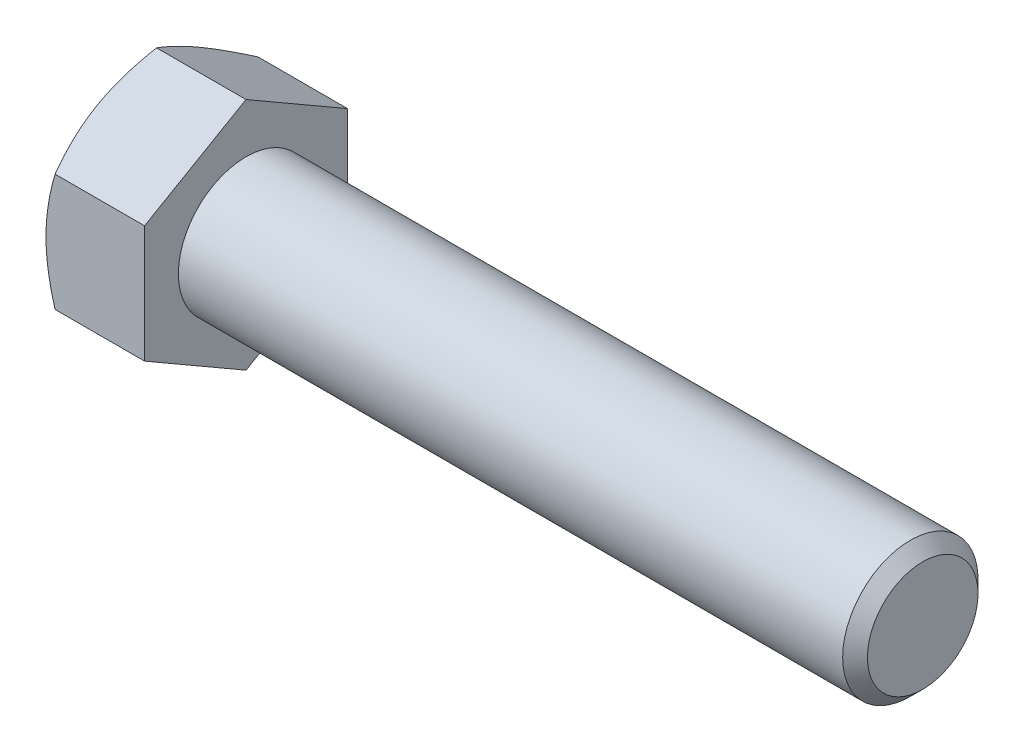
ISO-10303-21;
HEADER;
FILE_DESCRIPTION(('STEP AP214'),'2;1');
FILE_NAME('part.step','',(''),(''),'','','');
FILE_SCHEMA(('AUTOMOTIVE_DESIGN { 1 0 10303 214 1 1 1 1 }'));
ENDSEC;
DATA;
#1=APPLICATION_CONTEXT('core data for automotive mechanical design processes');
#2=APPLICATION_PROTOCOL_DEFINITION('international standard','automotive_design',2000,#1);
#3=PRODUCT_CONTEXT('',#1,'mechanical');
#4=PRODUCT('Part','Part','',(#3));
#5=PRODUCT_RELATED_PRODUCT_CATEGORY('part','',(#4));
#6=PRODUCT_DEFINITION_FORMATION('','',#4);
#7=PRODUCT_DEFINITION_CONTEXT('part definition',#1,'design');
#8=PRODUCT_DEFINITION('design','',#6,#7);
#9=PRODUCT_DEFINITION_SHAPE('','',#8);
#10=(LENGTH_UNIT() NAMED_UNIT(*) SI_UNIT(.MILLI.,.METRE.));
#11=(NAMED_UNIT(*) PLANE_ANGLE_UNIT() SI_UNIT($,.RADIAN.));
#12=(NAMED_UNIT(*) SI_UNIT($,.STERADIAN.) SOLID_ANGLE_UNIT());
#13=UNCERTAINTY_MEASURE_WITH_UNIT(LENGTH_MEASURE(1.E-05),#10,'distance_accuracy_value','');
#14=(GEOMETRIC_REPRESENTATION_CONTEXT(3) GLOBAL_UNCERTAINTY_ASSIGNED_CONTEXT((#13)) GLOBAL_UNIT_ASSIGNED_CONTEXT((#10,
#11,#12)) REPRESENTATION_CONTEXT('',''));
#15=CARTESIAN_POINT('',(0.,0.,0.));
#16=DIRECTION('',(0.,0.,1.));
#17=DIRECTION('',(1.,0.,0.));
#18=AXIS2_PLACEMENT_3D('',#15,#16,#17);
#19=CARTESIAN_POINT('',(9.2456,5.49926131403118,-9.525));
#20=DIRECTION('',(0.,-0.866025403784438,0.500000000000001));
#21=DIRECTION('',(0.,-0.500000000000001,-0.866025403784438));
#22=AXIS2_PLACEMENT_3D('',#19,#20,#21);
#23=PLANE('',#22);
#24=CARTESIAN_POINT('',(0.850805353685338,10.9986380981162,0.000199999999999582));
#25=CARTESIAN_POINT('',(0.781023201247652,10.8777523132173,-0.209180321357815));
#26=CARTESIAN_POINT('',(0.714408233957874,10.7564158029679,-0.419341321922845));
#27=CARTESIAN_POINT('',(0.588391469790024,10.5127697532954,-0.841348659019077));
#28=CARTESIAN_POINT('',(0.528992045309775,10.3904599078574,-1.05319552558363));
#29=CARTESIAN_POINT('',(0.362766604707595,10.0215595864394,-1.69214962520808));
#30=CARTESIAN_POINT('',(0.268218329918824,9.77351282584137,-2.12177921721668));
#31=CARTESIAN_POINT('',(0.157351628845432,9.40232220358294,-2.76470023426138));
#32=CARTESIAN_POINT('',(0.125769866148955,9.28028730086356,-2.97607088606807));
#33=CARTESIAN_POINT('',(0.0728092531292055,9.03565248016184,-3.39979082482397));
#34=CARTESIAN_POINT('',(0.051430599181033,8.91305255135051,-3.61214013052952));
#35=CARTESIAN_POINT('',(0.0194239766724823,8.66764818787802,-4.03719295646297));
#36=CARTESIAN_POINT('',(0.00878323258550216,8.54484417077186,-4.24989575346439));
#37=CARTESIAN_POINT('',(-0.00152146504907495,8.29912270270345,-4.67549782066929));
#38=CARTESIAN_POINT('',(-0.00118575773535193,8.17620525536319,-4.8883970845993));
#39=CARTESIAN_POINT('',(0.00969884023177768,7.94640807689151,-5.28641747314822));
#40=CARTESIAN_POINT('',(0.0189199445075662,7.83951212670956,-5.4715666899867));
#41=CARTESIAN_POINT('',(0.0454848010115649,7.62597023317658,-5.84143209913029));
#42=CARTESIAN_POINT('',(0.0628291278252538,7.5193243080471,-6.02614825987472));
#43=CARTESIAN_POINT('',(0.126636878025748,7.19979976097279,-6.57958100967286));
#44=CARTESIAN_POINT('',(0.184867121471558,6.98748672019119,-6.94731798341605));
#45=CARTESIAN_POINT('',(0.330443291970775,6.56060850831896,-7.68669273502289));
#46=CARTESIAN_POINT('',(0.41840629634645,6.3460978161353,-8.05823615265175));
#47=CARTESIAN_POINT('',(0.618045797355986,5.92027529884848,-8.79578238759941));
#48=CARTESIAN_POINT('',(0.729675405460146,5.70895802095901,-9.16179464942111));
#49=CARTESIAN_POINT('',(0.850805353685331,5.49914584397734,-9.5252));
#50=B_SPLINE_CURVE_WITH_KNOTS('',3,(#24,#25,#26,#27,#28,#29,#30,#31,#32,#33,#34,#35,#36,#37,#38,
#39,#40,#41,#42,#43,#44,#45,#46,#47,#48,#49),.UNSPECIFIED.,.F.,.F.,(4,2,2,2,2,2,2,2,2,2,2,2,4),
(0.,0.754861746958002,1.50997101692212,3.02340406075151,3.76154608748043,4.49970232035707,
5.23697928598072,5.97423347202913,6.61604550518408,7.25790294292824,8.54252993638602,
9.85564695316764,11.1661863217647),.UNSPECIFIED.);
#51=CARTESIAN_POINT('',(0.850738685968814,10.9985226280624,0.));
#52=VERTEX_POINT('',#51);
#53=CARTESIAN_POINT('',(0.,8.24889197104677,-4.76250000000001));
#54=VERTEX_POINT('',#53);
#55=EDGE_CURVE('E49',#52,#54,#50,.T.);
#56=ORIENTED_EDGE('',*,*,#55,.F.);
#57=DIRECTION('',(-1.,0.,0.));
#58=VECTOR('',#57,1.);
#59=CARTESIAN_POINT('',(9.2456,10.9985226280624,0.));
#60=LINE('',#59,#58);
#61=CARTESIAN_POINT('',(9.2456,10.9985226280624,0.));
#62=VERTEX_POINT('',#61);
#63=EDGE_CURVE('E145',#62,#52,#60,.T.);
#64=ORIENTED_EDGE('',*,*,#63,.F.);
#65=DIRECTION('',(0.,0.500000000000001,0.866025403784438));
#66=VECTOR('',#65,1.);
#67=CARTESIAN_POINT('',(9.2456,5.49926131403118,-9.525));
#68=LINE('',#67,#66);
#69=CARTESIAN_POINT('',(9.2456,5.49926131403118,-9.525));
#70=VERTEX_POINT('',#69);
#71=EDGE_CURVE('E236',#70,#62,#68,.T.);
#72=ORIENTED_EDGE('',*,*,#71,.F.);
#73=DIRECTION('',(-1.,0.,0.));
#74=VECTOR('',#73,1.);
#75=CARTESIAN_POINT('',(9.2456,5.49926131403118,-9.525));
#76=LINE('',#75,#74);
#77=CARTESIAN_POINT('',(0.850738685968808,5.49926131403118,-9.525));
#78=VERTEX_POINT('',#77);
#79=EDGE_CURVE('E133',#70,#78,#76,.T.);
#80=ORIENTED_EDGE('',*,*,#79,.T.);
#81=EDGE_CURVE('E127',#54,#78,#50,.T.);
#82=ORIENTED_EDGE('',*,*,#81,.F.);
#83=EDGE_LOOP('',(#56,#64,#72,#80,#82));
#84=FACE_BOUND('',#83,.T.);
#85=ADVANCED_FACE('F33',(#84),#23,.F.);
#86=CARTESIAN_POINT('',(9.2456,10.9985226280624,0.));
#87=DIRECTION('',(0.,-0.866025403784438,-0.500000000000001));
#88=DIRECTION('',(0.,0.500000000000001,-0.866025403784438));
#89=AXIS2_PLACEMENT_3D('',#86,#87,#88);
#90=PLANE('',#89);
#91=CARTESIAN_POINT('',(0.850805353685332,5.49914584397734,9.5252));
#92=CARTESIAN_POINT('',(0.781023201247648,5.62003162887628,9.31581967864219));
#93=CARTESIAN_POINT('',(0.71440823395787,5.74136813912567,9.10565867807715));
#94=CARTESIAN_POINT('',(0.58839146979002,5.98501418879817,8.68365134098092));
#95=CARTESIAN_POINT('',(0.52899204530977,6.1073240342362,8.47180447441637));
#96=CARTESIAN_POINT('',(0.36276660470759,6.47622435565419,7.83285037479193));
#97=CARTESIAN_POINT('',(0.268218329918821,6.72427111625218,7.40322078278332));
#98=CARTESIAN_POINT('',(0.157351628845429,7.09546173851061,6.76029976573862));
#99=CARTESIAN_POINT('',(0.125769866148953,7.21749664122999,6.54892911393193));
#100=CARTESIAN_POINT('',(0.0728092531292032,7.46213146193172,6.12520917517604));
#101=CARTESIAN_POINT('',(0.0514305991810314,7.58473139074305,5.91285986947049));
#102=CARTESIAN_POINT('',(0.0194239766724808,7.83013575421554,5.48780704353704));
#103=CARTESIAN_POINT('',(0.00878323258550018,7.95293977132169,5.27510424653562));
#104=CARTESIAN_POINT('',(-0.00152146504907647,8.1986612393901,4.84950217933072));
#105=CARTESIAN_POINT('',(-0.00118575773535245,8.32157868673037,4.63660291540071));
#106=CARTESIAN_POINT('',(0.00969884023177815,8.55137586520205,4.23858252685179));
#107=CARTESIAN_POINT('',(0.0189199445075668,8.658271815384,4.05343331001331));
#108=CARTESIAN_POINT('',(0.0454848010115661,8.87181370891698,3.68356790086971));
#109=CARTESIAN_POINT('',(0.0628291278252554,8.97845963404645,3.49885174012528));
#110=CARTESIAN_POINT('',(0.12663687802575,9.29798418112076,2.94541899032714));
#111=CARTESIAN_POINT('',(0.18486712147156,9.51029722190237,2.57768201658395));
#112=CARTESIAN_POINT('',(0.330443291970779,9.93717543377459,1.83830726497711));
#113=CARTESIAN_POINT('',(0.418406296346454,10.1516861259583,1.46676384734825));
#114=CARTESIAN_POINT('',(0.618045797355993,10.5775086432451,0.729217612400586));
#115=CARTESIAN_POINT('',(0.729675405460153,10.7888259211345,0.363205350578885));
#116=CARTESIAN_POINT('',(0.850805353685338,10.9986380981162,-0.000199999999999493));
#117=B_SPLINE_CURVE_WITH_KNOTS('',3,(#91,#92,#93,#94,#95,#96,#97,#98,#99,#100,#101,#102,#103,
#104,#105,#106,#107,#108,#109,#110,#111,#112,#113,#114,#115,#116),.UNSPECIFIED.,.F.,.F.,(4,2,2,
2,2,2,2,2,2,2,2,2,4),(0.,0.754861746958003,1.50997101692211,3.02340406075151,3.76154608748042,
4.49970232035707,5.23697928598072,5.97423347202913,6.61604550518408,7.25790294292823,
8.54252993638602,9.85564695316764,11.1661863217647),.UNSPECIFIED.);
#118=CARTESIAN_POINT('',(0.850738685968808,5.49926131403118,9.525));
#119=VERTEX_POINT('',#118);
#120=CARTESIAN_POINT('',(0.,8.24889197104677,4.76250000000001));
#121=VERTEX_POINT('',#120);
#122=EDGE_CURVE('E56',#119,#121,#117,.T.);
#123=ORIENTED_EDGE('',*,*,#122,.F.);
#124=DIRECTION('',(-1.,0.,0.));
#125=VECTOR('',#124,1.);
#126=CARTESIAN_POINT('',(9.2456,5.49926131403118,9.525));
#127=LINE('',#126,#125);
#128=CARTESIAN_POINT('',(9.2456,5.49926131403118,9.525));
#129=VERTEX_POINT('',#128);
#130=EDGE_CURVE('E143',#129,#119,#127,.T.);
#131=ORIENTED_EDGE('',*,*,#130,.F.);
#132=DIRECTION('',(0.,-0.500000000000001,0.866025403784438));
#133=VECTOR('',#132,1.);
#134=CARTESIAN_POINT('',(9.2456,10.9985226280624,0.));
#135=LINE('',#134,#133);
#136=EDGE_CURVE('E234',#62,#129,#135,.T.);
#137=ORIENTED_EDGE('',*,*,#136,.F.);
#138=ORIENTED_EDGE('',*,*,#63,.T.);
#139=EDGE_CURVE('E160',#121,#52,#117,.T.);
#140=ORIENTED_EDGE('',*,*,#139,.F.);
#141=EDGE_LOOP('',(#123,#131,#137,#138,#140));
#142=FACE_BOUND('',#141,.T.);
#143=ADVANCED_FACE('F166',(#142),#90,.F.);
#144=CARTESIAN_POINT('',(9.2456,5.49926131403118,9.525));
#145=DIRECTION('',(0.,0.,-1.));
#146=DIRECTION('',(0.,1.,0.));
#147=AXIS2_PLACEMENT_3D('',#144,#145,#146);
#148=PLANE('',#147);
#149=CARTESIAN_POINT('',(4.65297862037688,-14.781011537015,9.525));
#150=CARTESIAN_POINT('',(4.55200114715193,-14.5729402852111,9.525));
#151=CARTESIAN_POINT('',(4.4515265786935,-14.3646250848645,9.525));
#152=CARTESIAN_POINT('',(4.25169715286499,-13.9474558852266,9.525));
#153=CARTESIAN_POINT('',(4.15234230671206,-13.7386018805634,9.525));
#154=CARTESIAN_POINT('',(3.85610205099883,-13.1110997607544,9.525));
#155=CARTESIAN_POINT('',(3.66107082960236,-12.6915729931106,9.525));
#156=CARTESIAN_POINT('',(3.27608312858325,-11.8474364822057,9.525));
#157=CARTESIAN_POINT('',(3.08615996532047,-11.4228115073574,9.525));
#158=CARTESIAN_POINT('',(2.71407238177896,-10.5701875185262,9.525));
#159=CARTESIAN_POINT('',(2.5319075952033,-10.1421886649677,9.525));
#160=CARTESIAN_POINT('',(2.17173180429313,-9.26840827813856,9.525));
#161=CARTESIAN_POINT('',(1.9940386576789,-8.8224950008379,9.525));
#162=CARTESIAN_POINT('',(1.65207801721168,-7.92545654420872,9.525));
#163=CARTESIAN_POINT('',(1.48781202819995,-7.47433078714346,9.525));
#164=CARTESIAN_POINT('',(1.17701101316588,-6.56698486655185,9.525));
#165=CARTESIAN_POINT('',(1.03044020741254,-6.11077709193767,9.525));
#166=CARTESIAN_POINT('',(0.759723980483506,-5.1918346177866,9.525));
#167=CARTESIAN_POINT('',(0.635571508924631,-4.72910201978221,9.525));
#168=CARTESIAN_POINT('',(0.416296039050125,-3.79927533752508,9.525));
#169=CARTESIAN_POINT('',(0.321019170057398,-3.33221854629067,9.525));
#170=CARTESIAN_POINT('',(0.203895327451554,-2.62737339600217,9.525));
#171=CARTESIAN_POINT('',(0.16915107389592,-2.39169815061155,9.525));
#172=CARTESIAN_POINT('',(0.108940898318593,-1.91917305347025,9.525));
#173=CARTESIAN_POINT('',(0.0834740799032027,-1.68232331744248,9.525));
#174=CARTESIAN_POINT('',(0.0426462139312223,-1.21086692656677,9.525));
#175=CARTESIAN_POINT('',(0.0271575476633158,-0.976271367110184,9.525));
#176=CARTESIAN_POINT('',(0.00611497588125638,-0.50663550835013,9.525));
#177=CARTESIAN_POINT('',(0.000560905148256311,-0.271595216507935,9.525));
#178=CARTESIAN_POINT('',(-0.000479967130014283,0.198511625521888,9.525));
#179=CARTESIAN_POINT('',(0.0040333360047001,0.433578175957137,9.525));
#180=CARTESIAN_POINT('',(0.0230169602301711,0.903311845760747,9.525));
#181=CARTESIAN_POINT('',(0.037487777199467,1.13797894465318,9.525));
#182=CARTESIAN_POINT('',(0.083892600255165,1.70156520124285,9.525));
#183=CARTESIAN_POINT('',(0.12052919651862,2.03010533279804,9.525));
#184=CARTESIAN_POINT('',(0.211324091602473,2.68473880481518,9.525));
#185=CARTESIAN_POINT('',(0.265484757419761,3.01083180864913,9.525));
#186=CARTESIAN_POINT('',(0.451380100954846,3.98506326236031,9.525));
#187=CARTESIAN_POINT('',(0.606495020287632,4.62879899966704,9.525));
#188=CARTESIAN_POINT('',(0.875429331040967,5.59158230761081,9.525));
#189=CARTESIAN_POINT('',(0.972405254148345,5.91562142498137,9.525));
#190=CARTESIAN_POINT('',(1.17640873944311,6.56055109427995,9.525));
#191=CARTESIAN_POINT('',(1.28343637317876,6.88144162377831,9.525));
#192=CARTESIAN_POINT('',(1.50582732452006,7.52017826031916,9.525));
#193=CARTESIAN_POINT('',(1.62118794488169,7.83802531508889,9.525));
#194=CARTESIAN_POINT('',(1.85888923276597,8.47108431753843,9.525));
#195=CARTESIAN_POINT('',(1.98122977986944,8.78629631057137,9.525));
#196=CARTESIAN_POINT('',(2.30063477473475,9.58716274344886,9.525));
#197=CARTESIAN_POINT('',(2.50178184914485,10.0711868010732,9.525));
#198=CARTESIAN_POINT('',(2.91473175915868,11.0346830910319,9.525));
#199=CARTESIAN_POINT('',(3.12653548938557,11.5141549371794,9.525));
#200=CARTESIAN_POINT('',(3.55844219501523,12.4695072078833,9.525));
#201=CARTESIAN_POINT('',(3.77854763060888,12.9453865168534,9.525));
#202=CARTESIAN_POINT('',(4.22520690147574,13.8940827740469,9.525));
#203=CARTESIAN_POINT('',(4.45176054223739,14.3668998141172,9.525));
#204=CARTESIAN_POINT('',(4.91030379097836,15.3106675431073,9.525));
#205=CARTESIAN_POINT('',(5.14230026399124,15.7816148901446,9.525));
#206=CARTESIAN_POINT('',(5.61043419215088,16.7214473383478,9.525));
#207=CARTESIAN_POINT('',(5.84657167260893,17.1903324268864,9.525));
#208=CARTESIAN_POINT('',(6.32217781224721,18.1263065902911,9.525));
#209=CARTESIAN_POINT('',(6.56164589082984,18.5933959605109,9.525));
#210=CARTESIAN_POINT('',(7.04336394069364,19.5261387752273,9.525));
#211=CARTESIAN_POINT('',(7.28561392275062,19.9917922141529,9.525));
#212=CARTESIAN_POINT('',(7.96929589684109,21.2980525735578,9.525));
#213=CARTESIAN_POINT('',(8.41334550545556,22.1372892884429,9.525));
#214=CARTESIAN_POINT('',(9.30698696587615,23.8128512405548,9.525));
#215=CARTESIAN_POINT('',(9.75657908081867,24.6491763371134,9.525));
#216=CARTESIAN_POINT('',(10.6586387717617,26.3171534678506,9.525));
#217=CARTESIAN_POINT('',(11.1110942986639,27.1488120225724,9.525));
#218=CARTESIAN_POINT('',(11.7921739162077,28.3949535337001,9.525));
#219=CARTESIAN_POINT('',(12.0195924714625,28.8100962859172,9.525));
#220=CARTESIAN_POINT('',(12.4751463022628,29.639987673022,9.525));
#221=CARTESIAN_POINT('',(12.7032815768536,30.0547363084337,9.525));
#222=CARTESIAN_POINT('',(12.9317320981893,30.4693112735413,9.525));
#223=B_SPLINE_CURVE_WITH_KNOTS('',3,(#149,#150,#151,#152,#153,#154,#155,#156,#157,#158,#159,
#160,#161,#162,#163,#164,#165,#166,#167,#168,#169,#170,#171,#172,#173,#174,#175,#176,#177,#178,
#179,#180,#181,#182,#183,#184,#185,#186,#187,#188,#189,#190,#191,#192,#193,#194,#195,#196,#197,
#198,#199,#200,#201,#202,#203,#204,#205,#206,#207,#208,#209,#210,#211,#212,#213,#214,#215,#216,
#217,#218,#219,#220,#221,#222),.UNSPECIFIED.,.F.,.F.,(4,2,2,2,2,2,2,2,2,2,2,2,2,2,2,2,2,2,2,2,2,
2,2,2,2,2,2,2,2,2,2,2,2,2,2,2,4),(0.,0.693836530065473,1.38768000467711,2.77557197306441,
4.17100213127209,5.56636633371374,7.00624082844753,8.44627647568976,9.88334978465858,
11.3199703556576,12.7487952013331,13.4633089952187,14.17775373385,14.8828692578227,
15.5879730551522,16.2930841841453,16.9982304298141,17.9894005555578,18.9807046157554,
20.9643780189742,21.979010565197,22.9936503341406,24.0079631407782,25.0222584535638,
26.5945433134849,28.1669603872144,29.7398471619,31.3126865402824,32.8876294971052,
34.4625820838974,36.0372634793314,37.6119509764132,40.4603369601845,43.3088586989349,
46.1491565493342,47.5692138973609,48.9892693546768),.UNSPECIFIED.);
#224=CARTESIAN_POINT('',(0.850738685968817,-5.49926131403121,9.525));
#225=VERTEX_POINT('',#224);
#226=CARTESIAN_POINT('',(0.,0.,9.525));
#227=VERTEX_POINT('',#226);
#228=EDGE_CURVE('E246',#225,#227,#223,.T.);
#229=ORIENTED_EDGE('',*,*,#228,.F.);
#230=DIRECTION('',(-1.,0.,0.));
#231=VECTOR('',#230,1.);
#232=CARTESIAN_POINT('',(9.2456,-5.49926131403121,9.525));
#233=LINE('',#232,#231);
#234=CARTESIAN_POINT('',(9.2456,-5.49926131403121,9.525));
#235=VERTEX_POINT('',#234);
#236=EDGE_CURVE('E135',#235,#225,#233,.T.);
#237=ORIENTED_EDGE('',*,*,#236,.F.);
#238=DIRECTION('',(0.,-1.,0.));
#239=VECTOR('',#238,1.);
#240=CARTESIAN_POINT('',(9.2456,5.49926131403118,9.525));
#241=LINE('',#240,#239);
#242=EDGE_CURVE('E230',#129,#235,#241,.T.);
#243=ORIENTED_EDGE('',*,*,#242,.F.);
#244=ORIENTED_EDGE('',*,*,#130,.T.);
#245=EDGE_CURVE('E184',#227,#119,#223,.T.);
#246=ORIENTED_EDGE('',*,*,#245,.F.);
#247=EDGE_LOOP('',(#229,#237,#243,#244,#246));
#248=FACE_BOUND('',#247,.T.);
#249=ADVANCED_FACE('F252',(#248),#148,.F.);
#250=CARTESIAN_POINT('',(9.2456,-10.9985226280624,0.));
#251=DIRECTION('',(0.,0.866025403784438,-0.500000000000001));
#252=DIRECTION('',(0.,0.500000000000001,0.866025403784438));
#253=AXIS2_PLACEMENT_3D('',#250,#251,#252);
#254=PLANE('',#253);
#255=CARTESIAN_POINT('',(0.850805353685355,-10.9986380981162,-0.000200000000000233));
#256=CARTESIAN_POINT('',(0.78102320124767,-10.8777523132173,0.209180321357817));
#257=CARTESIAN_POINT('',(0.714408233957892,-10.7564158029679,0.419341321922847));
#258=CARTESIAN_POINT('',(0.588391469790041,-10.5127697532954,0.841348659019079));
#259=CARTESIAN_POINT('',(0.528992045309791,-10.3904599078574,1.05319552558364));
#260=CARTESIAN_POINT('',(0.36276660470761,-10.0215595864394,1.69214962520808));
#261=CARTESIAN_POINT('',(0.26821832991884,-9.7735128258414,2.12177921721669));
#262=CARTESIAN_POINT('',(0.157351628845447,-9.40232220358297,2.76470023426139));
#263=CARTESIAN_POINT('',(0.12576986614897,-9.28028730086359,2.97607088606808));
#264=CARTESIAN_POINT('',(0.0728092531292197,-9.03565248016186,3.39979082482398));
#265=CARTESIAN_POINT('',(0.0514305991810478,-8.91305255135053,3.61214013052953));
#266=CARTESIAN_POINT('',(0.019423976672497,-8.66764818787804,4.03719295646297));
#267=CARTESIAN_POINT('',(0.00878323258551609,-8.54484417077188,4.2498957534644));
#268=CARTESIAN_POINT('',(-0.00152146504906186,-8.29912270270347,4.67549782066929));
#269=CARTESIAN_POINT('',(-0.00118575773533882,-8.17620525536321,4.8883970845993));
#270=CARTESIAN_POINT('',(0.00969884023179151,-7.94640807689153,5.28641747314823));
#271=CARTESIAN_POINT('',(0.0189199445075806,-7.83951212670958,5.47156668998671));
#272=CARTESIAN_POINT('',(0.0454848010115796,-7.6259702331766,5.8414320991303));
#273=CARTESIAN_POINT('',(0.0628291278252681,-7.51932430804712,6.02614825987474));
#274=CARTESIAN_POINT('',(0.126636878025761,-7.19979976097281,6.57958100967288));
#275=CARTESIAN_POINT('',(0.184867121471571,-6.98748672019121,6.94731798341606));
#276=CARTESIAN_POINT('',(0.330443291970787,-6.56060850831899,7.6866927350229));
#277=CARTESIAN_POINT('',(0.418406296346461,-6.34609781613533,8.05823615265176));
#278=CARTESIAN_POINT('',(0.618045797355997,-5.9202752988485,8.79578238759942));
#279=CARTESIAN_POINT('',(0.729675405460157,-5.70895802095904,9.16179464942112));
#280=CARTESIAN_POINT('',(0.850805353685341,-5.49914584397737,9.5252));
#281=B_SPLINE_CURVE_WITH_KNOTS('',3,(#255,#256,#257,#258,#259,#260,#261,#262,#263,#264,#265,
#266,#267,#268,#269,#270,#271,#272,#273,#274,#275,#276,#277,#278,#279,#280),.UNSPECIFIED.,.F.,
.F.,(4,2,2,2,2,2,2,2,2,2,2,2,4),(0.,0.754861746958005,1.50997101692212,3.02340406075152,
3.76154608748043,4.49970232035708,5.23697928598074,5.97423347202915,6.6160455051841,
7.25790294292825,8.54252993638603,9.85564695316765,11.1661863217647),.UNSPECIFIED.);
#282=CARTESIAN_POINT('',(0.850738685968831,-10.9985226280624,0.));
#283=VERTEX_POINT('',#282);
#284=CARTESIAN_POINT('',(0.,-8.24889197104677,4.76250000000001));
#285=VERTEX_POINT('',#284);
#286=EDGE_CURVE('E168',#283,#285,#281,.T.);
#287=ORIENTED_EDGE('',*,*,#286,.F.);
#288=DIRECTION('',(-1.,0.,0.));
#289=VECTOR('',#288,1.);
#290=CARTESIAN_POINT('',(9.2456,-10.9985226280624,0.));
#291=LINE('',#290,#289);
#292=CARTESIAN_POINT('',(9.2456,-10.9985226280624,0.));
#293=VERTEX_POINT('',#292);
#294=EDGE_CURVE('E132',#293,#283,#291,.T.);
#295=ORIENTED_EDGE('',*,*,#294,.F.);
#296=DIRECTION('',(0.,-0.500000000000001,-0.866025403784438));
#297=VECTOR('',#296,1.);
#298=CARTESIAN_POINT('',(9.2456,-10.9985226280624,0.));
#299=LINE('',#298,#297);
#300=EDGE_CURVE('E228',#235,#293,#299,.T.);
#301=ORIENTED_EDGE('',*,*,#300,.F.);
#302=ORIENTED_EDGE('',*,*,#236,.T.);
#303=EDGE_CURVE('E170',#285,#225,#281,.T.);
#304=ORIENTED_EDGE('',*,*,#303,.F.);
#305=EDGE_LOOP('',(#287,#295,#301,#302,#304));
#306=FACE_BOUND('',#305,.T.);
#307=ADVANCED_FACE('F224',(#306),#254,.F.);
#308=CARTESIAN_POINT('',(9.2456,-5.4992613140312,-9.525));
#309=DIRECTION('',(0.,0.866025403784438,0.500000000000002));
#310=DIRECTION('',(0.,-0.500000000000002,0.866025403784438));
#311=AXIS2_PLACEMENT_3D('',#308,#309,#310);
#312=PLANE('',#311);
#313=CARTESIAN_POINT('',(0.850805353685338,-5.49914584397736,-9.5252));
#314=CARTESIAN_POINT('',(0.781023201247653,-5.62003162887631,-9.31581967864218));
#315=CARTESIAN_POINT('',(0.714408233957875,-5.74136813912569,-9.10565867807715));
#316=CARTESIAN_POINT('',(0.588391469790026,-5.9850141887982,-8.68365134098092));
#317=CARTESIAN_POINT('',(0.528992045309777,-6.10732403423622,-8.47180447441636));
#318=CARTESIAN_POINT('',(0.362766604707598,-6.47622435565421,-7.83285037479192));
#319=CARTESIAN_POINT('',(0.268218329918828,-6.72427111625221,-7.40322078278332));
#320=CARTESIAN_POINT('',(0.157351628845438,-7.09546173851064,-6.76029976573861));
#321=CARTESIAN_POINT('',(0.125769866148963,-7.21749664123002,-6.54892911393193));
#322=CARTESIAN_POINT('',(0.072809253129214,-7.46213146193175,-6.12520917517603));
#323=CARTESIAN_POINT('',(0.0514305991810419,-7.58473139074308,-5.91285986947048));
#324=CARTESIAN_POINT('',(0.0194239766724923,-7.83013575421556,-5.48780704353703));
#325=CARTESIAN_POINT('',(0.00878323258551287,-7.95293977132172,-5.27510424653561));
#326=CARTESIAN_POINT('',(-0.00152146504906313,-8.19866123939013,-4.84950217933071));
#327=CARTESIAN_POINT('',(-0.00118575773533966,-8.3215786867304,-4.63660291540071));
#328=CARTESIAN_POINT('',(0.00969884023179135,-8.55137586520208,-4.23858252685178));
#329=CARTESIAN_POINT('',(0.0189199445075808,-8.65827181538402,-4.0534333100133));
#330=CARTESIAN_POINT('',(0.0454848010115809,-8.87181370891701,-3.68356790086971));
#331=CARTESIAN_POINT('',(0.0628291278252702,-8.97845963404648,-3.49885174012527));
#332=CARTESIAN_POINT('',(0.126636878025765,-9.29798418112079,-2.94541899032713));
#333=CARTESIAN_POINT('',(0.184867121471576,-9.5102972219024,-2.57768201658395));
#334=CARTESIAN_POINT('',(0.330443291970795,-9.93717543377462,-1.83830726497711));
#335=CARTESIAN_POINT('',(0.418406296346471,-10.1516861259583,-1.46676384734825));
#336=CARTESIAN_POINT('',(0.61804579735601,-10.5775086432451,-0.729217612400586));
#337=CARTESIAN_POINT('',(0.729675405460171,-10.7888259211346,-0.363205350578886));
#338=CARTESIAN_POINT('',(0.850805353685355,-10.9986380981162,0.000199999999999104));
#339=B_SPLINE_CURVE_WITH_KNOTS('',3,(#313,#314,#315,#316,#317,#318,#319,#320,#321,#322,#323,
#324,#325,#326,#327,#328,#329,#330,#331,#332,#333,#334,#335,#336,#337,#338),.UNSPECIFIED.,.F.,
.F.,(4,2,2,2,2,2,2,2,2,2,2,2,4),(0.,0.754861746958005,1.50997101692212,3.02340406075151,
3.76154608748043,4.49970232035707,5.23697928598072,5.97423347202913,6.61604550518408,
7.25790294292824,8.54252993638602,9.85564695316764,11.1661863217647),.UNSPECIFIED.);
#340=CARTESIAN_POINT('',(0.850738685968813,-5.4992613140312,-9.525));
#341=VERTEX_POINT('',#340);
#342=CARTESIAN_POINT('',(0.,-8.24889197104677,-4.76250000000002));
#343=VERTEX_POINT('',#342);
#344=EDGE_CURVE('E109',#341,#343,#339,.T.);
#345=ORIENTED_EDGE('',*,*,#344,.F.);
#346=DIRECTION('',(-1.,0.,0.));
#347=VECTOR('',#346,1.);
#348=CARTESIAN_POINT('',(9.2456,-5.4992613140312,-9.525));
#349=LINE('',#348,#347);
#350=CARTESIAN_POINT('',(9.2456,-5.4992613140312,-9.525));
#351=VERTEX_POINT('',#350);
#352=EDGE_CURVE('E123',#351,#341,#349,.T.);
#353=ORIENTED_EDGE('',*,*,#352,.F.);
#354=DIRECTION('',(0.,0.500000000000002,-0.866025403784438));
#355=VECTOR('',#354,1.);
#356=CARTESIAN_POINT('',(9.2456,-5.4992613140312,-9.525));
#357=LINE('',#356,#355);
#358=EDGE_CURVE('E226',#293,#351,#357,.T.);
#359=ORIENTED_EDGE('',*,*,#358,.F.);
#360=ORIENTED_EDGE('',*,*,#294,.T.);
#361=EDGE_CURVE('E126',#343,#283,#339,.T.);
#362=ORIENTED_EDGE('',*,*,#361,.F.);
#363=EDGE_LOOP('',(#345,#353,#359,#360,#362));
#364=FACE_BOUND('',#363,.T.);
#365=ADVANCED_FACE('F121',(#364),#312,.F.);
#366=CARTESIAN_POINT('',(9.2456,5.49926131403118,-9.525));
#367=DIRECTION('',(0.,0.,1.));
#368=DIRECTION('',(1.,0.,0.));
#369=AXIS2_PLACEMENT_3D('',#366,#367,#368);
#370=PLANE('',#369);
#371=CARTESIAN_POINT('',(4.65297862020099,-14.7810115366526,-9.525));
#372=CARTESIAN_POINT('',(4.55200114697973,-14.5729402848548,-9.525));
#373=CARTESIAN_POINT('',(4.45152657852498,-14.3646250845143,-9.525));
#374=CARTESIAN_POINT('',(4.25169715270383,-13.9474558848886,-9.525));
#375=CARTESIAN_POINT('',(4.15234230655457,-13.7386018802315,-9.525));
#376=CARTESIAN_POINT('',(3.85610205085235,-13.1110997604408,-9.525));
#377=CARTESIAN_POINT('',(3.6610708294632,-12.6915729928092,-9.525));
#378=CARTESIAN_POINT('',(3.27608312845874,-11.8474364819289,-9.525));
#379=CARTESIAN_POINT('',(3.0861599652033,-11.4228115070931,-9.525));
#380=CARTESIAN_POINT('',(2.71407238167632,-10.5701875182868,-9.525));
#381=CARTESIAN_POINT('',(2.53190759510787,-10.1421886647409,-9.525));
#382=CARTESIAN_POINT('',(2.17173180421228,-9.26840827793762,-9.525));
#383=CARTESIAN_POINT('',(1.99403865760542,-8.82249500065039,-9.525));
#384=CARTESIAN_POINT('',(1.65207801715252,-7.92545654404829,-9.525));
#385=CARTESIAN_POINT('',(1.48781202814776,-7.47433078699668,-9.525));
#386=CARTESIAN_POINT('',(1.17701101312694,-6.56698486643262,-9.525));
#387=CARTESIAN_POINT('',(1.03044020737989,-6.11077709183234,-9.525));
#388=CARTESIAN_POINT('',(0.759723980462394,-5.19183461770946,-9.525));
#389=CARTESIAN_POINT('',(0.635571508908765,-4.72910201971934,-9.525));
#390=CARTESIAN_POINT('',(0.416296039044825,-3.79927533749824,-9.525));
#391=CARTESIAN_POINT('',(0.321019170056995,-3.33221854628569,-9.525));
#392=CARTESIAN_POINT('',(0.203895327456018,-2.62737339603034,-9.525));
#393=CARTESIAN_POINT('',(0.169151073901592,-2.39169815065082,-9.525));
#394=CARTESIAN_POINT('',(0.108940898325767,-1.91917305353182,-9.525));
#395=CARTESIAN_POINT('',(0.0834740799106702,-1.68232331751526,-9.525));
#396=CARTESIAN_POINT('',(0.04264621393829,-1.21086692666171,-9.525));
#397=CARTESIAN_POINT('',(0.0271575476697077,-0.97627136721609,-9.525));
#398=CARTESIAN_POINT('',(0.00611497588533354,-0.506635508477943,-9.525));
#399=CARTESIAN_POINT('',(0.000560905150694461,-0.271595216646689,-9.525));
#400=CARTESIAN_POINT('',(-0.000479967131792393,0.198511625361337,-9.525));
#401=CARTESIAN_POINT('',(0.00403333600034454,0.433578175785731,-9.525));
#402=CARTESIAN_POINT('',(0.0230169602197948,0.903311845567772,-9.525));
#403=CARTESIAN_POINT('',(0.0374877771856472,1.13797894444949,-9.525));
#404=CARTESIAN_POINT('',(0.0838926002328689,1.70156520102241,-9.525));
#405=CARTESIAN_POINT('',(0.120529196491428,2.03010533257162,-9.525));
#406=CARTESIAN_POINT('',(0.211324091565226,2.68473880457706,-9.525));
#407=CARTESIAN_POINT('',(0.265484757377355,3.01083180840529,-9.525));
#408=CARTESIAN_POINT('',(0.45138010089685,3.98506326209962,-9.525));
#409=CARTESIAN_POINT('',(0.606495020219099,4.62879899939554,-9.525));
#410=CARTESIAN_POINT('',(0.875429330956871,5.59158230732314,-9.525));
#411=CARTESIAN_POINT('',(0.972405254059025,5.9156214246882,-9.525));
#412=CARTESIAN_POINT('',(1.17640873934349,6.56055109397583,-9.525));
#413=CARTESIAN_POINT('',(1.28343637307407,6.88144162346875,-9.525));
#414=CARTESIAN_POINT('',(1.50582732440541,7.52017825999874,-9.525));
#415=CARTESIAN_POINT('',(1.62118794476214,7.83802531476307,-9.525));
#416=CARTESIAN_POINT('',(1.85888923263679,8.4710843172018,-9.525));
#417=CARTESIAN_POINT('',(1.98122977973553,8.78629631022934,-9.525));
#418=CARTESIAN_POINT('',(2.30063477459309,9.58716274310341,-9.525));
#419=CARTESIAN_POINT('',(2.50178184900059,10.0711868007296,-9.525));
#420=CARTESIAN_POINT('',(2.91473175900992,11.0346830906918,-9.525));
#421=CARTESIAN_POINT('',(3.1265354892349,11.514154936841,-9.525));
#422=CARTESIAN_POINT('',(3.55844219486127,12.4695072075479,-9.525));
#423=CARTESIAN_POINT('',(3.77854763045353,12.9453865165195,-9.525));
#424=CARTESIAN_POINT('',(4.22520690131798,13.8940827737157,-9.525));
#425=CARTESIAN_POINT('',(4.45176054207862,14.3668998137873,-9.525));
#426=CARTESIAN_POINT('',(4.91030379081786,15.31066754278,-9.525));
#427=CARTESIAN_POINT('',(5.14230026383005,15.7816148898186,-9.525));
#428=CARTESIAN_POINT('',(5.61043419198849,16.7214473380242,-9.525));
#429=CARTESIAN_POINT('',(5.84657167244606,17.190332426564,-9.525));
#430=CARTESIAN_POINT('',(6.32217781208352,18.1263065899709,-9.525));
#431=CARTESIAN_POINT('',(6.56164589066582,18.5933959601918,-9.525));
#432=CARTESIAN_POINT('',(7.04336394052909,19.5261387749102,-9.525));
#433=CARTESIAN_POINT('',(7.28561392258587,19.9917922138368,-9.525));
#434=CARTESIAN_POINT('',(7.96929589667506,21.2980525732429,-9.525));
#435=CARTESIAN_POINT('',(8.41334550528854,22.137289288128,-9.525));
#436=CARTESIAN_POINT('',(9.30698696570736,23.81285124024,-9.525));
#437=CARTESIAN_POINT('',(9.7565790806491,24.6491763367986,-9.525));
#438=CARTESIAN_POINT('',(10.6586387715906,26.3171534675353,-9.525));
#439=CARTESIAN_POINT('',(11.1110942984919,27.1488120222569,-9.525));
#440=CARTESIAN_POINT('',(11.7921739160347,28.394953533384,-9.525));
#441=CARTESIAN_POINT('',(12.0195924712891,28.8100962856009,-9.525));
#442=CARTESIAN_POINT('',(12.4751463020887,29.6399876727052,-9.525));
#443=CARTESIAN_POINT('',(12.7032815766791,30.0547363081167,-9.525));
#444=CARTESIAN_POINT('',(12.9317320980145,30.469311273224,-9.525));
#445=B_SPLINE_CURVE_WITH_KNOTS('',3,(#371,#372,#373,#374,#375,#376,#377,#378,#379,#380,#381,
#382,#383,#384,#385,#386,#387,#388,#389,#390,#391,#392,#393,#394,#395,#396,#397,#398,#399,#400,
#401,#402,#403,#404,#405,#406,#407,#408,#409,#410,#411,#412,#413,#414,#415,#416,#417,#418,#419,
#420,#421,#422,#423,#424,#425,#426,#427,#428,#429,#430,#431,#432,#433,#434,#435,#436,#437,#438,
#439,#440,#441,#442,#443,#444),.UNSPECIFIED.,.F.,.F.,(4,2,2,2,2,2,2,2,2,2,2,2,2,2,2,2,2,2,2,2,2,
2,2,2,2,2,2,2,2,2,2,2,2,2,2,2,4),(0.,0.693836530044208,1.38768000463458,2.77557197297935,
4.17100213114403,5.56636633354268,7.00624082823088,8.44627647542749,9.88334978435085,
11.3199703553045,12.748795200913,13.4633089947651,14.177753733363,14.882869257303,
15.5879730545998,16.2930841835603,16.9982304291964,17.9894005549206,18.9807046150987,
20.9643780182785,21.979010564481,22.9936503334043,24.0079631400216,25.0222584527869,
26.5945433127102,28.1669603864419,29.7398471611297,31.3126865395143,32.8876294963396,
34.4625820831342,36.0372634785707,37.6119509756548,40.4603369594249,43.3088586981742,
46.1491565485714,47.569213896597,48.9892693539119),.UNSPECIFIED.);
#446=CARTESIAN_POINT('',(0.,0.,-9.525));
#447=VERTEX_POINT('',#446);
#448=EDGE_CURVE('E115',#78,#447,#445,.F.);
#449=ORIENTED_EDGE('',*,*,#448,.F.);
#450=ORIENTED_EDGE('',*,*,#79,.F.);
#451=DIRECTION('',(0.,1.,0.));
#452=VECTOR('',#451,1.);
#453=CARTESIAN_POINT('',(9.2456,5.49926131403118,-9.525));
#454=LINE('',#453,#452);
#455=EDGE_CURVE('E131',#351,#70,#454,.T.);
#456=ORIENTED_EDGE('',*,*,#455,.F.);
#457=ORIENTED_EDGE('',*,*,#352,.T.);
#458=EDGE_CURVE('E106',#447,#341,#445,.F.);
#459=ORIENTED_EDGE('',*,*,#458,.F.);
#460=EDGE_LOOP('',(#449,#450,#456,#457,#459));
#461=FACE_BOUND('',#460,.T.);
#462=ADVANCED_FACE('F129',(#461),#370,.F.);
#463=CARTESIAN_POINT('',(9.2456,0.,-19.05));
#464=DIRECTION('',(1.,0.,0.));
#465=DIRECTION('',(0.,0.,-1.));
#466=AXIS2_PLACEMENT_3D('',#463,#464,#465);
#467=PLANE('',#466);
#468=CARTESIAN_POINT('',(9.2456,0.,0.));
#469=DIRECTION('',(1.,0.,0.));
#470=DIRECTION('',(0.,0.,-1.));
#471=AXIS2_PLACEMENT_3D('',#468,#469,#470);
#472=CIRCLE('',#471,6.35);
#473=CARTESIAN_POINT('',(9.2456,0.,-6.35));
#474=VERTEX_POINT('',#473);
#475=EDGE_CURVE('E239',#474,#474,#472,.F.);
#476=ORIENTED_EDGE('',*,*,#475,.T.);
#477=EDGE_LOOP('',(#476));
#478=FACE_BOUND('',#477,.T.);
#479=ORIENTED_EDGE('',*,*,#71,.T.);
#480=ORIENTED_EDGE('',*,*,#136,.T.);
#481=ORIENTED_EDGE('',*,*,#242,.T.);
#482=ORIENTED_EDGE('',*,*,#300,.T.);
#483=ORIENTED_EDGE('',*,*,#358,.T.);
#484=ORIENTED_EDGE('',*,*,#455,.T.);
#485=EDGE_LOOP('',(#479,#480,#481,#482,#483,#484));
#486=FACE_BOUND('',#485,.T.);
#487=ADVANCED_FACE('F254',(#478,#486),#467,.T.);
#488=CARTESIAN_POINT('',(0.,0.,0.));
#489=DIRECTION('',(-1.,0.,0.));
#490=DIRECTION('',(0.,0.,1.));
#491=AXIS2_PLACEMENT_3D('',#488,#489,#490);
#492=CYLINDRICAL_SURFACE('',#491,6.35);
#493=ORIENTED_EDGE('',*,*,#475,.F.);
#494=EDGE_LOOP('',(#493));
#495=FACE_BOUND('',#494,.T.);
#496=CARTESIAN_POINT('',(71.58228,0.,0.));
#497=DIRECTION('',(-1.,0.,0.));
#498=DIRECTION('',(0.,0.,1.));
#499=AXIS2_PLACEMENT_3D('',#496,#497,#498);
#500=CIRCLE('',#499,6.35);
#501=CARTESIAN_POINT('',(71.58228,0.,6.35));
#502=VERTEX_POINT('',#501);
#503=EDGE_CURVE('E242',#502,#502,#500,.T.);
#504=ORIENTED_EDGE('',*,*,#503,.T.);
#505=EDGE_LOOP('',(#504));
#506=FACE_BOUND('',#505,.T.);
#507=ADVANCED_FACE('F285',(#495,#506),#492,.T.);
#508=CARTESIAN_POINT('',(72.7456,0.,0.));
#509=DIRECTION('',(-1.,0.,0.));
#510=DIRECTION('',(0.,0.,1.));
#511=AXIS2_PLACEMENT_3D('',#508,#509,#510);
#512=CONICAL_SURFACE('',#511,5.18668,0.78539816339745);
#513=ORIENTED_EDGE('',*,*,#503,.F.);
#514=EDGE_LOOP('',(#513));
#515=FACE_BOUND('',#514,.T.);
#516=CARTESIAN_POINT('',(72.7456,0.,0.));
#517=DIRECTION('',(-1.,0.,0.));
#518=DIRECTION('',(0.,0.,1.));
#519=AXIS2_PLACEMENT_3D('',#516,#517,#518);
#520=CIRCLE('',#519,5.18668);
#521=CARTESIAN_POINT('',(72.7456,0.,5.18668));
#522=VERTEX_POINT('',#521);
#523=EDGE_CURVE('E244',#522,#522,#520,.T.);
#524=ORIENTED_EDGE('',*,*,#523,.T.);
#525=EDGE_LOOP('',(#524));
#526=FACE_BOUND('',#525,.T.);
#527=ADVANCED_FACE('F288',(#515,#526),#512,.T.);
#528=CARTESIAN_POINT('',(72.7456,0.,0.));
#529=DIRECTION('',(-1.,0.,0.));
#530=DIRECTION('',(0.,0.,1.));
#531=AXIS2_PLACEMENT_3D('',#528,#529,#530);
#532=PLANE('',#531);
#533=ORIENTED_EDGE('',*,*,#523,.F.);
#534=EDGE_LOOP('',(#533));
#535=FACE_BOUND('',#534,.T.);
#536=ADVANCED_FACE('F198',(#535),#532,.F.);
#537=CARTESIAN_POINT('',(0.,0.,0.));
#538=DIRECTION('',(1.,0.,0.));
#539=DIRECTION('',(0.,0.,-1.));
#540=AXIS2_PLACEMENT_3D('',#537,#538,#539);
#541=CONICAL_SURFACE('',#540,9.525,1.0471975511966);
#542=ORIENTED_EDGE('',*,*,#344,.T.);
#543=CARTESIAN_POINT('',(0.,0.,0.));
#544=DIRECTION('',(1.,0.,0.));
#545=DIRECTION('',(0.,0.,-1.));
#546=AXIS2_PLACEMENT_3D('',#543,#544,#545);
#547=CIRCLE('',#546,9.525);
#548=EDGE_CURVE('E37',#343,#447,#547,.T.);
#549=ORIENTED_EDGE('',*,*,#548,.T.);
#550=ORIENTED_EDGE('',*,*,#458,.T.);
#551=EDGE_LOOP('',(#542,#549,#550));
#552=FACE_BOUND('',#551,.T.);
#553=ADVANCED_FACE('F108',(#552),#541,.T.);
#554=ORIENTED_EDGE('',*,*,#286,.T.);
#555=EDGE_CURVE('E150',#285,#343,#547,.T.);
#556=ORIENTED_EDGE('',*,*,#555,.T.);
#557=ORIENTED_EDGE('',*,*,#361,.T.);
#558=EDGE_LOOP('',(#554,#556,#557));
#559=FACE_BOUND('',#558,.T.);
#560=ADVANCED_FACE('F197',(#559),#541,.T.);
#561=ORIENTED_EDGE('',*,*,#228,.T.);
#562=EDGE_CURVE('E151',#227,#285,#547,.T.);
#563=ORIENTED_EDGE('',*,*,#562,.T.);
#564=ORIENTED_EDGE('',*,*,#303,.T.);
#565=EDGE_LOOP('',(#561,#563,#564));
#566=FACE_BOUND('',#565,.T.);
#567=ADVANCED_FACE('F192',(#566),#541,.T.);
#568=ORIENTED_EDGE('',*,*,#245,.T.);
#569=ORIENTED_EDGE('',*,*,#122,.T.);
#570=CARTESIAN_POINT('',(0.,0.,0.));
#571=DIRECTION('',(-1.,0.,0.));
#572=DIRECTION('',(0.,0.,1.));
#573=AXIS2_PLACEMENT_3D('',#570,#571,#572);
#574=CIRCLE('',#573,9.525);
#575=EDGE_CURVE('E116',#227,#121,#574,.T.);
#576=ORIENTED_EDGE('',*,*,#575,.F.);
#577=EDGE_LOOP('',(#568,#569,#576));
#578=FACE_BOUND('',#577,.T.);
#579=ADVANCED_FACE('F196',(#578),#541,.T.);
#580=ORIENTED_EDGE('',*,*,#139,.T.);
#581=ORIENTED_EDGE('',*,*,#55,.T.);
#582=EDGE_CURVE('E42',#54,#121,#547,.T.);
#583=ORIENTED_EDGE('',*,*,#582,.T.);
#584=EDGE_LOOP('',(#580,#581,#583));
#585=FACE_BOUND('',#584,.T.);
#586=ADVANCED_FACE('F159',(#585),#541,.T.);
#587=ORIENTED_EDGE('',*,*,#81,.T.);
#588=ORIENTED_EDGE('',*,*,#448,.T.);
#589=EDGE_CURVE('E11',#447,#54,#547,.T.);
#590=ORIENTED_EDGE('',*,*,#589,.T.);
#591=EDGE_LOOP('',(#587,#588,#590));
#592=FACE_BOUND('',#591,.T.);
#593=ADVANCED_FACE('F257',(#592),#541,.T.);
#594=CARTESIAN_POINT('',(0.,0.,-19.05));
#595=DIRECTION('',(1.,0.,0.));
#596=DIRECTION('',(0.,0.,-1.));
#597=AXIS2_PLACEMENT_3D('',#594,#595,#596);
#598=PLANE('',#597);
#599=ORIENTED_EDGE('',*,*,#589,.F.);
#600=ORIENTED_EDGE('',*,*,#548,.F.);
#601=ORIENTED_EDGE('',*,*,#555,.F.);
#602=ORIENTED_EDGE('',*,*,#562,.F.);
#603=ORIENTED_EDGE('',*,*,#575,.T.);
#604=ORIENTED_EDGE('',*,*,#582,.F.);
#605=EDGE_LOOP('',(#599,#600,#601,#602,#603,#604));
#606=FACE_BOUND('',#605,.T.);
#607=ADVANCED_FACE('F163',(#606),#598,.F.);
#608=CLOSED_SHELL('',(#85,#143,#249,#307,#365,#462,#487,#507,#527,#536,#553,#560,#567,#579,#586,
#593,#607));
#609=MANIFOLD_SOLID_BREP('B2',#608);
#610=ADVANCED_BREP_SHAPE_REPRESENTATION('',(#18,#609),#14);
#611=SHAPE_DEFINITION_REPRESENTATION(#9,#610);
ENDSEC;
END-ISO-10303-21;
